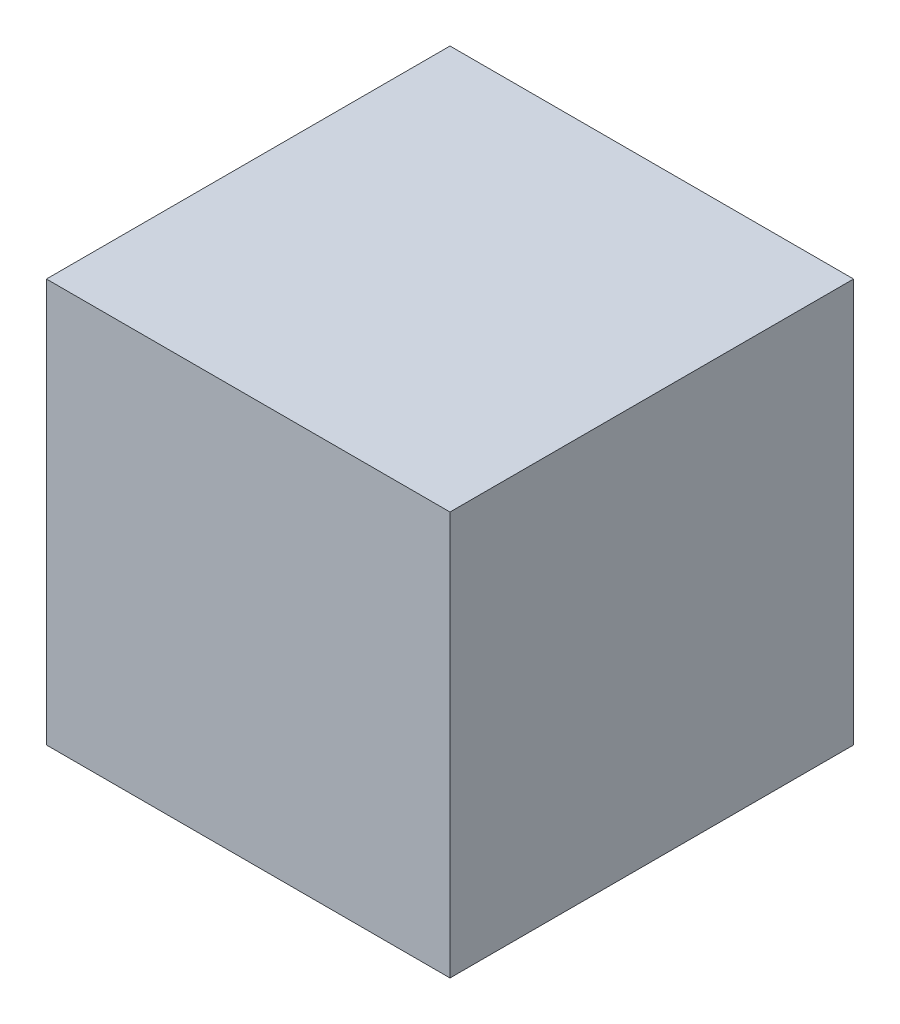
ISO-10303-21;
HEADER;
FILE_DESCRIPTION(('STEP AP214'),'2;1');
FILE_NAME('part.step','',(''),(''),'','','');
FILE_SCHEMA(('AUTOMOTIVE_DESIGN { 1 0 10303 214 1 1 1 1 }'));
ENDSEC;
DATA;
#1=APPLICATION_CONTEXT('core data for automotive mechanical design processes');
#2=APPLICATION_PROTOCOL_DEFINITION('international standard','automotive_design',2000,#1);
#3=PRODUCT_CONTEXT('',#1,'mechanical');
#4=PRODUCT('Part','Part','',(#3));
#5=PRODUCT_RELATED_PRODUCT_CATEGORY('part','',(#4));
#6=PRODUCT_DEFINITION_FORMATION('','',#4);
#7=PRODUCT_DEFINITION_CONTEXT('part definition',#1,'design');
#8=PRODUCT_DEFINITION('design','',#6,#7);
#9=PRODUCT_DEFINITION_SHAPE('','',#8);
#10=(LENGTH_UNIT() NAMED_UNIT(*) SI_UNIT(.MILLI.,.METRE.));
#11=(NAMED_UNIT(*) PLANE_ANGLE_UNIT() SI_UNIT($,.RADIAN.));
#12=(NAMED_UNIT(*) SI_UNIT($,.STERADIAN.) SOLID_ANGLE_UNIT());
#13=UNCERTAINTY_MEASURE_WITH_UNIT(LENGTH_MEASURE(1.E-05),#10,'distance_accuracy_value','');
#14=(GEOMETRIC_REPRESENTATION_CONTEXT(3) GLOBAL_UNCERTAINTY_ASSIGNED_CONTEXT((#13)) GLOBAL_UNIT_ASSIGNED_CONTEXT((#10,
#11,#12)) REPRESENTATION_CONTEXT('',''));
#15=CARTESIAN_POINT('',(0.,0.,0.));
#16=DIRECTION('',(0.,0.,1.));
#17=DIRECTION('',(1.,0.,0.));
#18=AXIS2_PLACEMENT_3D('',#15,#16,#17);
#19=CARTESIAN_POINT('',(0.,0.,23.));
#20=DIRECTION('',(-1.,0.,0.));
#21=DIRECTION('',(0.,0.,1.));
#22=AXIS2_PLACEMENT_3D('',#19,#20,#21);
#23=PLANE('',#22);
#24=DIRECTION('',(0.,1.,0.));
#25=VECTOR('',#24,1.);
#26=CARTESIAN_POINT('',(0.,0.,0.));
#27=LINE('',#26,#25);
#28=CARTESIAN_POINT('',(0.,0.,0.));
#29=VERTEX_POINT('',#28);
#30=CARTESIAN_POINT('',(0.,23.,0.));
#31=VERTEX_POINT('',#30);
#32=EDGE_CURVE('E107',#29,#31,#27,.T.);
#33=ORIENTED_EDGE('',*,*,#32,.T.);
#34=DIRECTION('',(0.,0.,-1.));
#35=VECTOR('',#34,1.);
#36=CARTESIAN_POINT('',(0.,23.,23.));
#37=LINE('',#36,#35);
#38=CARTESIAN_POINT('',(0.,23.,23.));
#39=VERTEX_POINT('',#38);
#40=EDGE_CURVE('E11',#39,#31,#37,.T.);
#41=ORIENTED_EDGE('',*,*,#40,.F.);
#42=DIRECTION('',(0.,1.,0.));
#43=VECTOR('',#42,1.);
#44=CARTESIAN_POINT('',(0.,0.,23.));
#45=LINE('',#44,#43);
#46=CARTESIAN_POINT('',(0.,0.,23.));
#47=VERTEX_POINT('',#46);
#48=EDGE_CURVE('E91',#47,#39,#45,.T.);
#49=ORIENTED_EDGE('',*,*,#48,.F.);
#50=DIRECTION('',(0.,0.,-1.));
#51=VECTOR('',#50,1.);
#52=CARTESIAN_POINT('',(0.,0.,23.));
#53=LINE('',#52,#51);
#54=EDGE_CURVE('E103',#47,#29,#53,.T.);
#55=ORIENTED_EDGE('',*,*,#54,.T.);
#56=EDGE_LOOP('',(#33,#41,#49,#55));
#57=FACE_BOUND('',#56,.T.);
#58=ADVANCED_FACE('F39',(#57),#23,.F.);
#59=CARTESIAN_POINT('',(0.,23.,23.));
#60=DIRECTION('',(0.,-1.,0.));
#61=DIRECTION('',(1.,0.,0.));
#62=AXIS2_PLACEMENT_3D('',#59,#60,#61);
#63=PLANE('',#62);
#64=DIRECTION('',(-1.,0.,0.));
#65=VECTOR('',#64,1.);
#66=CARTESIAN_POINT('',(0.,23.,0.));
#67=LINE('',#66,#65);
#68=CARTESIAN_POINT('',(-23.,23.,0.));
#69=VERTEX_POINT('',#68);
#70=EDGE_CURVE('E96',#31,#69,#67,.T.);
#71=ORIENTED_EDGE('',*,*,#70,.T.);
#72=DIRECTION('',(0.,0.,-1.));
#73=VECTOR('',#72,1.);
#74=CARTESIAN_POINT('',(-23.,23.,23.));
#75=LINE('',#74,#73);
#76=CARTESIAN_POINT('',(-23.,23.,23.));
#77=VERTEX_POINT('',#76);
#78=EDGE_CURVE('E48',#77,#69,#75,.T.);
#79=ORIENTED_EDGE('',*,*,#78,.F.);
#80=DIRECTION('',(-1.,0.,0.));
#81=VECTOR('',#80,1.);
#82=CARTESIAN_POINT('',(0.,23.,23.));
#83=LINE('',#82,#81);
#84=EDGE_CURVE('E86',#39,#77,#83,.T.);
#85=ORIENTED_EDGE('',*,*,#84,.F.);
#86=ORIENTED_EDGE('',*,*,#40,.T.);
#87=EDGE_LOOP('',(#71,#79,#85,#86));
#88=FACE_BOUND('',#87,.T.);
#89=ADVANCED_FACE('F95',(#88),#63,.F.);
#90=CARTESIAN_POINT('',(-23.,0.,23.));
#91=DIRECTION('',(1.,0.,0.));
#92=DIRECTION('',(0.,0.,-1.));
#93=AXIS2_PLACEMENT_3D('',#90,#91,#92);
#94=PLANE('',#93);
#95=DIRECTION('',(0.,-1.,0.));
#96=VECTOR('',#95,1.);
#97=CARTESIAN_POINT('',(-23.,0.,0.));
#98=LINE('',#97,#96);
#99=CARTESIAN_POINT('',(-23.,0.,0.));
#100=VERTEX_POINT('',#99);
#101=EDGE_CURVE('E73',#69,#100,#98,.T.);
#102=ORIENTED_EDGE('',*,*,#101,.T.);
#103=DIRECTION('',(0.,0.,-1.));
#104=VECTOR('',#103,1.);
#105=CARTESIAN_POINT('',(-23.,0.,23.));
#106=LINE('',#105,#104);
#107=CARTESIAN_POINT('',(-23.,0.,23.));
#108=VERTEX_POINT('',#107);
#109=EDGE_CURVE('E98',#108,#100,#106,.T.);
#110=ORIENTED_EDGE('',*,*,#109,.F.);
#111=DIRECTION('',(0.,-1.,0.));
#112=VECTOR('',#111,1.);
#113=CARTESIAN_POINT('',(-23.,0.,23.));
#114=LINE('',#113,#112);
#115=EDGE_CURVE('E89',#77,#108,#114,.T.);
#116=ORIENTED_EDGE('',*,*,#115,.F.);
#117=ORIENTED_EDGE('',*,*,#78,.T.);
#118=EDGE_LOOP('',(#102,#110,#116,#117));
#119=FACE_BOUND('',#118,.T.);
#120=ADVANCED_FACE('F99',(#119),#94,.F.);
#121=CARTESIAN_POINT('',(0.,0.,23.));
#122=DIRECTION('',(0.,1.,0.));
#123=DIRECTION('',(-1.,0.,0.));
#124=AXIS2_PLACEMENT_3D('',#121,#122,#123);
#125=PLANE('',#124);
#126=DIRECTION('',(1.,0.,0.));
#127=VECTOR('',#126,1.);
#128=CARTESIAN_POINT('',(0.,0.,0.));
#129=LINE('',#128,#127);
#130=EDGE_CURVE('E79',#100,#29,#129,.T.);
#131=ORIENTED_EDGE('',*,*,#130,.T.);
#132=ORIENTED_EDGE('',*,*,#54,.F.);
#133=DIRECTION('',(1.,0.,0.));
#134=VECTOR('',#133,1.);
#135=CARTESIAN_POINT('',(0.,0.,23.));
#136=LINE('',#135,#134);
#137=EDGE_CURVE('E56',#108,#47,#136,.T.);
#138=ORIENTED_EDGE('',*,*,#137,.F.);
#139=ORIENTED_EDGE('',*,*,#109,.T.);
#140=EDGE_LOOP('',(#131,#132,#138,#139));
#141=FACE_BOUND('',#140,.T.);
#142=ADVANCED_FACE('F120',(#141),#125,.F.);
#143=CARTESIAN_POINT('',(0.,0.,23.));
#144=DIRECTION('',(0.,0.,1.));
#145=DIRECTION('',(1.,0.,0.));
#146=AXIS2_PLACEMENT_3D('',#143,#144,#145);
#147=PLANE('',#146);
#148=ORIENTED_EDGE('',*,*,#48,.T.);
#149=ORIENTED_EDGE('',*,*,#84,.T.);
#150=ORIENTED_EDGE('',*,*,#115,.T.);
#151=ORIENTED_EDGE('',*,*,#137,.T.);
#152=EDGE_LOOP('',(#148,#149,#150,#151));
#153=FACE_BOUND('',#152,.T.);
#154=ADVANCED_FACE('F87',(#153),#147,.T.);
#155=CARTESIAN_POINT('',(0.,0.,0.));
#156=DIRECTION('',(0.,0.,1.));
#157=DIRECTION('',(1.,0.,0.));
#158=AXIS2_PLACEMENT_3D('',#155,#156,#157);
#159=PLANE('',#158);
#160=ORIENTED_EDGE('',*,*,#32,.F.);
#161=ORIENTED_EDGE('',*,*,#130,.F.);
#162=ORIENTED_EDGE('',*,*,#101,.F.);
#163=ORIENTED_EDGE('',*,*,#70,.F.);
#164=EDGE_LOOP('',(#160,#161,#162,#163));
#165=FACE_BOUND('',#164,.T.);
#166=ADVANCED_FACE('F123',(#165),#159,.F.);
#167=CLOSED_SHELL('',(#58,#89,#120,#142,#154,#166));
#168=MANIFOLD_SOLID_BREP('B2',#167);
#169=ADVANCED_BREP_SHAPE_REPRESENTATION('',(#18,#168),#14);
#170=SHAPE_DEFINITION_REPRESENTATION(#9,#169);
ENDSEC;
END-ISO-10303-21;
